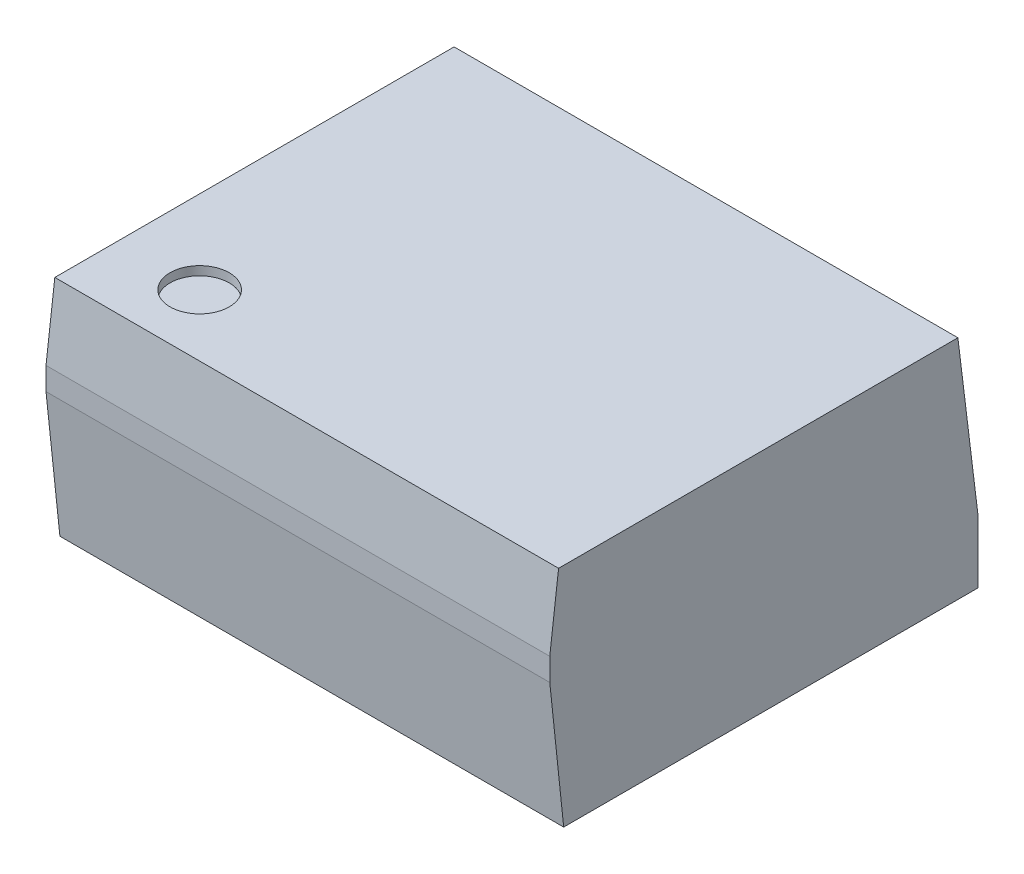
ISO-10303-21;
HEADER;
FILE_DESCRIPTION(('STEP AP214'),'2;1');
FILE_NAME('part.step','',(''),(''),'','','');
FILE_SCHEMA(('AUTOMOTIVE_DESIGN { 1 0 10303 214 1 1 1 1 }'));
ENDSEC;
DATA;
#1=APPLICATION_CONTEXT('core data for automotive mechanical design processes');
#2=APPLICATION_PROTOCOL_DEFINITION('international standard','automotive_design',2000,#1);
#3=PRODUCT_CONTEXT('',#1,'mechanical');
#4=PRODUCT('Part','Part','',(#3));
#5=PRODUCT_RELATED_PRODUCT_CATEGORY('part','',(#4));
#6=PRODUCT_DEFINITION_FORMATION('','',#4);
#7=PRODUCT_DEFINITION_CONTEXT('part definition',#1,'design');
#8=PRODUCT_DEFINITION('design','',#6,#7);
#9=PRODUCT_DEFINITION_SHAPE('','',#8);
#10=(LENGTH_UNIT() NAMED_UNIT(*) SI_UNIT(.MILLI.,.METRE.));
#11=(NAMED_UNIT(*) PLANE_ANGLE_UNIT() SI_UNIT($,.RADIAN.));
#12=(NAMED_UNIT(*) SI_UNIT($,.STERADIAN.) SOLID_ANGLE_UNIT());
#13=UNCERTAINTY_MEASURE_WITH_UNIT(LENGTH_MEASURE(1.E-05),#10,'distance_accuracy_value','');
#14=(GEOMETRIC_REPRESENTATION_CONTEXT(3) GLOBAL_UNCERTAINTY_ASSIGNED_CONTEXT((#13)) GLOBAL_UNIT_ASSIGNED_CONTEXT((#10,
#11,#12)) REPRESENTATION_CONTEXT('',''));
#15=CARTESIAN_POINT('',(0.,0.,0.));
#16=DIRECTION('',(0.,0.,1.));
#17=DIRECTION('',(1.,0.,0.));
#18=AXIS2_PLACEMENT_3D('',#15,#16,#17);
#19=CARTESIAN_POINT('',(-3.556,0.,3.556));
#20=DIRECTION('',(-1.,0.,0.));
#21=DIRECTION('',(0.,0.,1.));
#22=AXIS2_PLACEMENT_3D('',#19,#20,#21);
#23=PLANE('',#22);
#24=DIRECTION('',(0.,0.,1.));
#25=VECTOR('',#24,1.);
#26=CARTESIAN_POINT('',(-3.556,1.27,3.556));
#27=LINE('',#26,#25);
#28=CARTESIAN_POINT('',(-3.556,1.26999999999999,3.55600000000009));
#29=VERTEX_POINT('',#28);
#30=CARTESIAN_POINT('',(-3.556,1.27,11.176));
#31=VERTEX_POINT('',#30);
#32=EDGE_CURVE('E145',#29,#31,#27,.T.);
#33=ORIENTED_EDGE('',*,*,#32,.T.);
#34=DIRECTION('',(0.,1.,0.));
#35=VECTOR('',#34,1.);
#36=CARTESIAN_POINT('',(-3.556,0.,11.176));
#37=LINE('',#36,#35);
#38=CARTESIAN_POINT('',(-3.556,0.,11.176));
#39=VERTEX_POINT('',#38);
#40=EDGE_CURVE('E97',#31,#39,#37,.F.);
#41=ORIENTED_EDGE('',*,*,#40,.T.);
#42=DIRECTION('',(0.,0.,-1.));
#43=VECTOR('',#42,1.);
#44=CARTESIAN_POINT('',(-3.556,0.,3.556));
#45=LINE('',#44,#43);
#46=CARTESIAN_POINT('',(-3.556,0.,3.556));
#47=VERTEX_POINT('',#46);
#48=EDGE_CURVE('E125',#47,#39,#45,.F.);
#49=ORIENTED_EDGE('',*,*,#48,.F.);
#50=DIRECTION('',(0.,1.,0.));
#51=VECTOR('',#50,1.);
#52=CARTESIAN_POINT('',(-3.556,0.,3.556));
#53=LINE('',#52,#51);
#54=EDGE_CURVE('E135',#29,#47,#53,.F.);
#55=ORIENTED_EDGE('',*,*,#54,.F.);
#56=EDGE_LOOP('',(#33,#41,#49,#55));
#57=FACE_BOUND('',#56,.T.);
#58=ADVANCED_FACE('F17',(#57),#23,.F.);
#59=CARTESIAN_POINT('',(-3.556,0.,11.176));
#60=DIRECTION('',(0.,0.,1.));
#61=DIRECTION('',(1.,0.,0.));
#62=AXIS2_PLACEMENT_3D('',#59,#60,#61);
#63=PLANE('',#62);
#64=DIRECTION('',(1.,0.,0.));
#65=VECTOR('',#64,1.);
#66=CARTESIAN_POINT('',(0.,1.27,11.176));
#67=LINE('',#66,#65);
#68=CARTESIAN_POINT('',(3.556,1.27,11.176));
#69=VERTEX_POINT('',#68);
#70=EDGE_CURVE('E109',#31,#69,#67,.T.);
#71=ORIENTED_EDGE('',*,*,#70,.T.);
#72=DIRECTION('',(0.,1.,0.));
#73=VECTOR('',#72,1.);
#74=CARTESIAN_POINT('',(3.556,0.,11.176));
#75=LINE('',#74,#73);
#76=CARTESIAN_POINT('',(3.556,0.,11.176));
#77=VERTEX_POINT('',#76);
#78=EDGE_CURVE('E102',#69,#77,#75,.F.);
#79=ORIENTED_EDGE('',*,*,#78,.T.);
#80=DIRECTION('',(1.,0.,0.));
#81=VECTOR('',#80,1.);
#82=CARTESIAN_POINT('',(-5.08,0.,11.176));
#83=LINE('',#82,#81);
#84=EDGE_CURVE('E106',#39,#77,#83,.T.);
#85=ORIENTED_EDGE('',*,*,#84,.F.);
#86=ORIENTED_EDGE('',*,*,#40,.F.);
#87=EDGE_LOOP('',(#71,#79,#85,#86));
#88=FACE_BOUND('',#87,.T.);
#89=ADVANCED_FACE('F104',(#88),#63,.F.);
#90=CARTESIAN_POINT('',(3.556,0.,11.176));
#91=DIRECTION('',(1.,0.,0.));
#92=DIRECTION('',(0.,0.,-1.));
#93=AXIS2_PLACEMENT_3D('',#90,#91,#92);
#94=PLANE('',#93);
#95=DIRECTION('',(0.,0.,1.));
#96=VECTOR('',#95,1.);
#97=CARTESIAN_POINT('',(3.556,1.27,3.556));
#98=LINE('',#97,#96);
#99=CARTESIAN_POINT('',(3.556,1.26999999999999,3.55600000000009));
#100=VERTEX_POINT('',#99);
#101=EDGE_CURVE('E154',#69,#100,#98,.F.);
#102=ORIENTED_EDGE('',*,*,#101,.T.);
#103=DIRECTION('',(0.,1.,0.));
#104=VECTOR('',#103,1.);
#105=CARTESIAN_POINT('',(3.556,0.,3.556));
#106=LINE('',#105,#104);
#107=CARTESIAN_POINT('',(3.556,0.,3.556));
#108=VERTEX_POINT('',#107);
#109=EDGE_CURVE('E114',#108,#100,#106,.T.);
#110=ORIENTED_EDGE('',*,*,#109,.F.);
#111=DIRECTION('',(0.,0.,-1.));
#112=VECTOR('',#111,1.);
#113=CARTESIAN_POINT('',(3.556,0.,3.556));
#114=LINE('',#113,#112);
#115=EDGE_CURVE('E117',#77,#108,#114,.T.);
#116=ORIENTED_EDGE('',*,*,#115,.F.);
#117=ORIENTED_EDGE('',*,*,#78,.F.);
#118=EDGE_LOOP('',(#102,#110,#116,#117));
#119=FACE_BOUND('',#118,.T.);
#120=ADVANCED_FACE('F118',(#119),#94,.F.);
#121=CARTESIAN_POINT('',(0.,0.,12.192));
#122=DIRECTION('',(0.,0.,1.));
#123=DIRECTION('',(1.,0.,0.));
#124=AXIS2_PLACEMENT_3D('',#121,#122,#123);
#125=PLANE('',#124);
#126=DIRECTION('',(0.,1.,0.));
#127=VECTOR('',#126,1.);
#128=CARTESIAN_POINT('',(-5.08,4.572,12.192));
#129=LINE('',#128,#127);
#130=CARTESIAN_POINT('',(-5.08,2.66699999999999,12.192));
#131=VERTEX_POINT('',#130);
#132=CARTESIAN_POINT('',(-5.08,3.1242,12.192));
#133=VERTEX_POINT('',#132);
#134=EDGE_CURVE('E172',#131,#133,#129,.T.);
#135=ORIENTED_EDGE('',*,*,#134,.F.);
#136=DIRECTION('',(1.,0.,0.));
#137=VECTOR('',#136,1.);
#138=CARTESIAN_POINT('',(6.096,2.667,12.192));
#139=LINE('',#138,#137);
#140=CARTESIAN_POINT('',(5.08,2.66699999999999,12.192));
#141=VERTEX_POINT('',#140);
#142=EDGE_CURVE('E126',#131,#141,#139,.T.);
#143=ORIENTED_EDGE('',*,*,#142,.T.);
#144=DIRECTION('',(0.,1.,0.));
#145=VECTOR('',#144,1.);
#146=CARTESIAN_POINT('',(5.08,0.,12.192));
#147=LINE('',#146,#145);
#148=CARTESIAN_POINT('',(5.08,3.1242,12.192));
#149=VERTEX_POINT('',#148);
#150=EDGE_CURVE('E113',#141,#149,#147,.T.);
#151=ORIENTED_EDGE('',*,*,#150,.T.);
#152=DIRECTION('',(1.,0.,0.));
#153=VECTOR('',#152,1.);
#154=CARTESIAN_POINT('',(6.096,3.1242,12.192));
#155=LINE('',#154,#153);
#156=EDGE_CURVE('E180',#149,#133,#155,.F.);
#157=ORIENTED_EDGE('',*,*,#156,.T.);
#158=EDGE_LOOP('',(#135,#143,#151,#157));
#159=FACE_BOUND('',#158,.T.);
#160=ADVANCED_FACE('F270',(#159),#125,.T.);
#161=CARTESIAN_POINT('',(6.096,0.,11.9116870045463));
#162=DIRECTION('',(0.,0.104528463267697,-0.994521895368269));
#163=DIRECTION('',(0.,0.994521895368269,0.104528463267697));
#164=AXIS2_PLACEMENT_3D('',#161,#162,#163);
#165=PLANE('',#164);
#166=DIRECTION('',(0.,0.994521895368269,0.104528463267691));
#167=VECTOR('',#166,1.);
#168=CARTESIAN_POINT('',(-5.08,0.,11.9116870045463));
#169=LINE('',#168,#167);
#170=CARTESIAN_POINT('',(-5.08,0.,11.9116870045463));
#171=VERTEX_POINT('',#170);
#172=EDGE_CURVE('E168',#171,#131,#169,.T.);
#173=ORIENTED_EDGE('',*,*,#172,.F.);
#174=DIRECTION('',(1.,0.,0.));
#175=VECTOR('',#174,1.);
#176=CARTESIAN_POINT('',(-5.08,0.,11.9116870045463));
#177=LINE('',#176,#175);
#178=CARTESIAN_POINT('',(5.08,0.,11.9116870045463));
#179=VERTEX_POINT('',#178);
#180=EDGE_CURVE('E121',#179,#171,#177,.F.);
#181=ORIENTED_EDGE('',*,*,#180,.F.);
#182=DIRECTION('',(0.,-0.994521895368269,-0.104528463267691));
#183=VECTOR('',#182,1.);
#184=CARTESIAN_POINT('',(5.08,2.667,12.192));
#185=LINE('',#184,#183);
#186=EDGE_CURVE('E186',#141,#179,#185,.T.);
#187=ORIENTED_EDGE('',*,*,#186,.F.);
#188=ORIENTED_EDGE('',*,*,#142,.F.);
#189=EDGE_LOOP('',(#173,#181,#187,#188));
#190=FACE_BOUND('',#189,.T.);
#191=ADVANCED_FACE('F169',(#190),#165,.F.);
#192=CARTESIAN_POINT('',(-5.08,0.,3.556));
#193=DIRECTION('',(0.,-1.,0.));
#194=DIRECTION('',(0.,0.,-1.));
#195=AXIS2_PLACEMENT_3D('',#192,#193,#194);
#196=PLANE('',#195);
#197=DIRECTION('',(1.,0.,0.));
#198=VECTOR('',#197,1.);
#199=CARTESIAN_POINT('',(0.,0.,3.556));
#200=LINE('',#199,#198);
#201=CARTESIAN_POINT('',(-5.08,0.,3.556));
#202=VERTEX_POINT('',#201);
#203=EDGE_CURVE('E139',#202,#47,#200,.T.);
#204=ORIENTED_EDGE('',*,*,#203,.T.);
#205=ORIENTED_EDGE('',*,*,#48,.T.);
#206=ORIENTED_EDGE('',*,*,#84,.T.);
#207=ORIENTED_EDGE('',*,*,#115,.T.);
#208=DIRECTION('',(1.,0.,0.));
#209=VECTOR('',#208,1.);
#210=CARTESIAN_POINT('',(0.,0.,3.556));
#211=LINE('',#210,#209);
#212=CARTESIAN_POINT('',(5.08,0.,3.556));
#213=VERTEX_POINT('',#212);
#214=EDGE_CURVE('E151',#108,#213,#211,.T.);
#215=ORIENTED_EDGE('',*,*,#214,.T.);
#216=DIRECTION('',(0.,0.,-1.));
#217=VECTOR('',#216,1.);
#218=CARTESIAN_POINT('',(5.08,0.,3.556));
#219=LINE('',#218,#217);
#220=EDGE_CURVE('E163',#179,#213,#219,.T.);
#221=ORIENTED_EDGE('',*,*,#220,.F.);
#222=ORIENTED_EDGE('',*,*,#180,.T.);
#223=DIRECTION('',(0.,0.,1.));
#224=VECTOR('',#223,1.);
#225=CARTESIAN_POINT('',(-5.08,0.,3.556));
#226=LINE('',#225,#224);
#227=EDGE_CURVE('E148',#202,#171,#226,.T.);
#228=ORIENTED_EDGE('',*,*,#227,.F.);
#229=EDGE_LOOP('',(#204,#205,#206,#207,#215,#221,#222,#228));
#230=FACE_BOUND('',#229,.T.);
#231=ADVANCED_FACE('F124',(#230),#196,.T.);
#232=CARTESIAN_POINT('',(0.,1.27,3.556));
#233=DIRECTION('',(0.,1.,0.));
#234=DIRECTION('',(0.,0.,1.));
#235=AXIS2_PLACEMENT_3D('',#232,#233,#234);
#236=PLANE('',#235);
#237=ORIENTED_EDGE('',*,*,#70,.F.);
#238=ORIENTED_EDGE('',*,*,#32,.F.);
#239=DIRECTION('',(1.,0.,0.));
#240=VECTOR('',#239,1.);
#241=CARTESIAN_POINT('',(6.096,1.26999999999991,3.55600000000071));
#242=LINE('',#241,#240);
#243=EDGE_CURVE('E191',#29,#100,#242,.T.);
#244=ORIENTED_EDGE('',*,*,#243,.T.);
#245=ORIENTED_EDGE('',*,*,#101,.F.);
#246=EDGE_LOOP('',(#237,#238,#244,#245));
#247=FACE_BOUND('',#246,.T.);
#248=ADVANCED_FACE('F261',(#247),#236,.F.);
#249=CARTESIAN_POINT('',(0.,0.,3.556));
#250=DIRECTION('',(0.,0.,1.));
#251=DIRECTION('',(1.,0.,0.));
#252=AXIS2_PLACEMENT_3D('',#249,#250,#251);
#253=PLANE('',#252);
#254=DIRECTION('',(1.,0.,0.));
#255=VECTOR('',#254,1.);
#256=CARTESIAN_POINT('',(6.096,1.26999999999991,3.55600000000071));
#257=LINE('',#256,#255);
#258=CARTESIAN_POINT('',(5.08,1.26999999999998,3.55600000000018));
#259=VERTEX_POINT('',#258);
#260=EDGE_CURVE('E194',#100,#259,#257,.T.);
#261=ORIENTED_EDGE('',*,*,#260,.T.);
#262=DIRECTION('',(0.,1.,0.));
#263=VECTOR('',#262,1.);
#264=CARTESIAN_POINT('',(5.08,0.,3.556));
#265=LINE('',#264,#263);
#266=EDGE_CURVE('E189',#213,#259,#265,.T.);
#267=ORIENTED_EDGE('',*,*,#266,.F.);
#268=ORIENTED_EDGE('',*,*,#214,.F.);
#269=ORIENTED_EDGE('',*,*,#109,.T.);
#270=EDGE_LOOP('',(#261,#267,#268,#269));
#271=FACE_BOUND('',#270,.T.);
#272=ADVANCED_FACE('F256',(#271),#253,.F.);
#273=CARTESIAN_POINT('',(0.,0.,3.556));
#274=DIRECTION('',(0.,0.,1.));
#275=DIRECTION('',(1.,0.,0.));
#276=AXIS2_PLACEMENT_3D('',#273,#274,#275);
#277=PLANE('',#276);
#278=DIRECTION('',(1.,0.,0.));
#279=VECTOR('',#278,1.);
#280=CARTESIAN_POINT('',(6.096,1.26999999999991,3.55600000000071));
#281=LINE('',#280,#279);
#282=CARTESIAN_POINT('',(-5.08,1.26999999999998,3.55600000000018));
#283=VERTEX_POINT('',#282);
#284=EDGE_CURVE('E142',#283,#29,#281,.T.);
#285=ORIENTED_EDGE('',*,*,#284,.T.);
#286=ORIENTED_EDGE('',*,*,#54,.T.);
#287=ORIENTED_EDGE('',*,*,#203,.F.);
#288=DIRECTION('',(0.,1.,0.));
#289=VECTOR('',#288,1.);
#290=CARTESIAN_POINT('',(-5.08,4.572,3.556));
#291=LINE('',#290,#289);
#292=EDGE_CURVE('E150',#283,#202,#291,.F.);
#293=ORIENTED_EDGE('',*,*,#292,.F.);
#294=EDGE_LOOP('',(#285,#286,#287,#293));
#295=FACE_BOUND('',#294,.T.);
#296=ADVANCED_FACE('F138',(#295),#277,.F.);
#297=CARTESIAN_POINT('',(-3.4036,4.3942,10.7696));
#298=DIRECTION('',(0.,-1.,0.));
#299=DIRECTION('',(0.,0.,-1.));
#300=AXIS2_PLACEMENT_3D('',#297,#298,#299);
#301=PLANE('',#300);
#302=CARTESIAN_POINT('',(-3.4036,4.3942,10.7696));
#303=DIRECTION('',(0.,-1.,0.));
#304=DIRECTION('',(0.,0.,-1.));
#305=AXIS2_PLACEMENT_3D('',#302,#303,#304);
#306=CIRCLE('',#305,0.5969);
#307=CARTESIAN_POINT('',(-3.4036,4.3942,10.1727));
#308=VERTEX_POINT('',#307);
#309=EDGE_CURVE('E20',#308,#308,#306,.F.);
#310=ORIENTED_EDGE('',*,*,#309,.T.);
#311=EDGE_LOOP('',(#310));
#312=FACE_BOUND('',#311,.T.);
#313=ADVANCED_FACE('F248',(#312),#301,.F.);
#314=CARTESIAN_POINT('',(-5.08,4.572,3.556));
#315=DIRECTION('',(-1.,0.,0.));
#316=DIRECTION('',(0.,0.,1.));
#317=AXIS2_PLACEMENT_3D('',#314,#315,#316);
#318=PLANE('',#317);
#319=DIRECTION('',(0.,0.,1.));
#320=VECTOR('',#319,1.);
#321=CARTESIAN_POINT('',(-5.08,4.572,3.556));
#322=LINE('',#321,#320);
#323=CARTESIAN_POINT('',(-5.08,4.572,3.96143462010196));
#324=VERTEX_POINT('',#323);
#325=CARTESIAN_POINT('',(-5.08,4.57200000000003,12.0142325127241));
#326=VERTEX_POINT('',#325);
#327=EDGE_CURVE('E200',#324,#326,#322,.T.);
#328=ORIENTED_EDGE('',*,*,#327,.F.);
#329=DIRECTION('',(0.,-0.992546151641328,-0.121869343405103));
#330=VECTOR('',#329,1.);
#331=CARTESIAN_POINT('',(-5.08,4.572,3.96143462010196));
#332=LINE('',#331,#330);
#333=EDGE_CURVE('E197',#324,#283,#332,.T.);
#334=ORIENTED_EDGE('',*,*,#333,.T.);
#335=ORIENTED_EDGE('',*,*,#292,.T.);
#336=ORIENTED_EDGE('',*,*,#227,.T.);
#337=ORIENTED_EDGE('',*,*,#172,.T.);
#338=ORIENTED_EDGE('',*,*,#134,.T.);
#339=DIRECTION('',(0.,0.992546151641328,-0.121869343405103));
#340=VECTOR('',#339,1.);
#341=CARTESIAN_POINT('',(-5.08,3.1242,12.192));
#342=LINE('',#341,#340);
#343=EDGE_CURVE('E178',#133,#326,#342,.T.);
#344=ORIENTED_EDGE('',*,*,#343,.T.);
#345=EDGE_LOOP('',(#328,#334,#335,#336,#337,#338,#344));
#346=FACE_BOUND('',#345,.T.);
#347=ADVANCED_FACE('F174',(#346),#318,.T.);
#348=CARTESIAN_POINT('',(6.096,3.1242,12.192));
#349=DIRECTION('',(0.,-0.121869343405103,-0.992546151641328));
#350=DIRECTION('',(0.,0.992546151641328,-0.121869343405103));
#351=AXIS2_PLACEMENT_3D('',#348,#349,#350);
#352=PLANE('',#351);
#353=DIRECTION('',(0.,-0.992546151641249,0.121869343405738));
#354=VECTOR('',#353,1.);
#355=CARTESIAN_POINT('',(5.08,4.572,12.0142325127239));
#356=LINE('',#355,#354);
#357=CARTESIAN_POINT('',(5.08,4.57200000000006,12.0142325127244));
#358=VERTEX_POINT('',#357);
#359=EDGE_CURVE('E183',#358,#149,#356,.T.);
#360=ORIENTED_EDGE('',*,*,#359,.F.);
#361=DIRECTION('',(1.,0.,0.));
#362=VECTOR('',#361,1.);
#363=CARTESIAN_POINT('',(5.08,4.572,12.0142325127239));
#364=LINE('',#363,#362);
#365=EDGE_CURVE('E203',#326,#358,#364,.T.);
#366=ORIENTED_EDGE('',*,*,#365,.F.);
#367=ORIENTED_EDGE('',*,*,#343,.F.);
#368=ORIENTED_EDGE('',*,*,#156,.F.);
#369=EDGE_LOOP('',(#360,#366,#367,#368));
#370=FACE_BOUND('',#369,.T.);
#371=ADVANCED_FACE('F220',(#370),#352,.F.);
#372=CARTESIAN_POINT('',(5.08,0.,3.556));
#373=DIRECTION('',(1.,0.,0.));
#374=DIRECTION('',(0.,0.,-1.));
#375=AXIS2_PLACEMENT_3D('',#372,#373,#374);
#376=PLANE('',#375);
#377=ORIENTED_EDGE('',*,*,#266,.T.);
#378=DIRECTION('',(0.,-0.992546151641328,-0.121869343405103));
#379=VECTOR('',#378,1.);
#380=CARTESIAN_POINT('',(5.08,4.572,3.96143462010196));
#381=LINE('',#380,#379);
#382=CARTESIAN_POINT('',(5.08,4.572,3.96143462010196));
#383=VERTEX_POINT('',#382);
#384=EDGE_CURVE('E34',#259,#383,#381,.F.);
#385=ORIENTED_EDGE('',*,*,#384,.T.);
#386=DIRECTION('',(0.,0.,1.));
#387=VECTOR('',#386,1.);
#388=CARTESIAN_POINT('',(5.08,4.572,3.556));
#389=LINE('',#388,#387);
#390=EDGE_CURVE('E206',#358,#383,#389,.F.);
#391=ORIENTED_EDGE('',*,*,#390,.F.);
#392=ORIENTED_EDGE('',*,*,#359,.T.);
#393=ORIENTED_EDGE('',*,*,#150,.F.);
#394=ORIENTED_EDGE('',*,*,#186,.T.);
#395=ORIENTED_EDGE('',*,*,#220,.T.);
#396=EDGE_LOOP('',(#377,#385,#391,#392,#393,#394,#395));
#397=FACE_BOUND('',#396,.T.);
#398=ADVANCED_FACE('F221',(#397),#376,.T.);
#399=CARTESIAN_POINT('',(6.096,4.572,3.96143462010196));
#400=DIRECTION('',(0.,-0.121869343405103,0.992546151641328));
#401=DIRECTION('',(0.,-0.992546151641328,-0.121869343405103));
#402=AXIS2_PLACEMENT_3D('',#399,#400,#401);
#403=PLANE('',#402);
#404=ORIENTED_EDGE('',*,*,#333,.F.);
#405=DIRECTION('',(1.,0.,0.));
#406=VECTOR('',#405,1.);
#407=CARTESIAN_POINT('',(5.08,4.572,3.96143462010196));
#408=LINE('',#407,#406);
#409=EDGE_CURVE('E26',#383,#324,#408,.F.);
#410=ORIENTED_EDGE('',*,*,#409,.F.);
#411=ORIENTED_EDGE('',*,*,#384,.F.);
#412=ORIENTED_EDGE('',*,*,#260,.F.);
#413=ORIENTED_EDGE('',*,*,#243,.F.);
#414=ORIENTED_EDGE('',*,*,#284,.F.);
#415=EDGE_LOOP('',(#404,#410,#411,#412,#413,#414));
#416=FACE_BOUND('',#415,.T.);
#417=ADVANCED_FACE('F214',(#416),#403,.F.);
#418=CARTESIAN_POINT('',(-3.4036,4.572,10.7696));
#419=DIRECTION('',(0.,-1.,0.));
#420=DIRECTION('',(0.,0.,-1.));
#421=AXIS2_PLACEMENT_3D('',#418,#419,#420);
#422=CYLINDRICAL_SURFACE('',#421,0.5969);
#423=ORIENTED_EDGE('',*,*,#309,.F.);
#424=EDGE_LOOP('',(#423));
#425=FACE_BOUND('',#424,.T.);
#426=CARTESIAN_POINT('',(-3.4036,4.572,10.7696));
#427=DIRECTION('',(0.,-1.,0.));
#428=DIRECTION('',(0.,0.,-1.));
#429=AXIS2_PLACEMENT_3D('',#426,#427,#428);
#430=CIRCLE('',#429,0.5969);
#431=CARTESIAN_POINT('',(-3.4036,4.572,10.1727));
#432=VERTEX_POINT('',#431);
#433=EDGE_CURVE('E11',#432,#432,#430,.T.);
#434=ORIENTED_EDGE('',*,*,#433,.F.);
#435=EDGE_LOOP('',(#434));
#436=FACE_BOUND('',#435,.T.);
#437=ADVANCED_FACE('F230',(#425,#436),#422,.F.);
#438=CARTESIAN_POINT('',(5.08,4.572,3.556));
#439=DIRECTION('',(0.,1.,0.));
#440=DIRECTION('',(0.,0.,1.));
#441=AXIS2_PLACEMENT_3D('',#438,#439,#440);
#442=PLANE('',#441);
#443=ORIENTED_EDGE('',*,*,#433,.T.);
#444=EDGE_LOOP('',(#443));
#445=FACE_BOUND('',#444,.T.);
#446=ORIENTED_EDGE('',*,*,#390,.T.);
#447=ORIENTED_EDGE('',*,*,#409,.T.);
#448=ORIENTED_EDGE('',*,*,#327,.T.);
#449=ORIENTED_EDGE('',*,*,#365,.T.);
#450=EDGE_LOOP('',(#446,#447,#448,#449));
#451=FACE_BOUND('',#450,.T.);
#452=ADVANCED_FACE('F211',(#445,#451),#442,.T.);
#453=CLOSED_SHELL('',(#58,#89,#120,#160,#191,#231,#248,#272,#296,#313,#347,#371,#398,#417,#437,#452));
#454=MANIFOLD_SOLID_BREP('B1',#453);
#455=ADVANCED_BREP_SHAPE_REPRESENTATION('',(#18,#454),#14);
#456=SHAPE_DEFINITION_REPRESENTATION(#9,#455);
ENDSEC;
END-ISO-10303-21;
